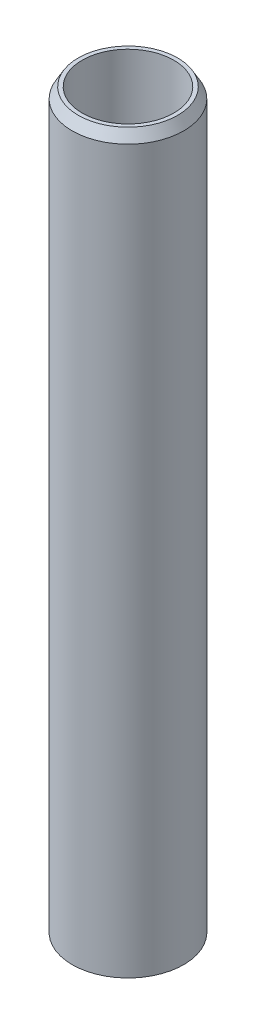
ISO-10303-21;
HEADER;
FILE_DESCRIPTION(('STEP AP214'),'2;1');
FILE_NAME('part.step','',(''),(''),'','','');
FILE_SCHEMA(('AUTOMOTIVE_DESIGN { 1 0 10303 214 1 1 1 1 }'));
ENDSEC;
DATA;
#1=APPLICATION_CONTEXT('core data for automotive mechanical design processes');
#2=APPLICATION_PROTOCOL_DEFINITION('international standard','automotive_design',2000,#1);
#3=PRODUCT_CONTEXT('',#1,'mechanical');
#4=PRODUCT('Part','Part','',(#3));
#5=PRODUCT_RELATED_PRODUCT_CATEGORY('part','',(#4));
#6=PRODUCT_DEFINITION_FORMATION('','',#4);
#7=PRODUCT_DEFINITION_CONTEXT('part definition',#1,'design');
#8=PRODUCT_DEFINITION('design','',#6,#7);
#9=PRODUCT_DEFINITION_SHAPE('','',#8);
#10=(LENGTH_UNIT() NAMED_UNIT(*) SI_UNIT(.MILLI.,.METRE.));
#11=(NAMED_UNIT(*) PLANE_ANGLE_UNIT() SI_UNIT($,.RADIAN.));
#12=(NAMED_UNIT(*) SI_UNIT($,.STERADIAN.) SOLID_ANGLE_UNIT());
#13=UNCERTAINTY_MEASURE_WITH_UNIT(LENGTH_MEASURE(1.E-05),#10,'distance_accuracy_value','');
#14=(GEOMETRIC_REPRESENTATION_CONTEXT(3) GLOBAL_UNCERTAINTY_ASSIGNED_CONTEXT((#13)) GLOBAL_UNIT_ASSIGNED_CONTEXT((#10,
#11,#12)) REPRESENTATION_CONTEXT('',''));
#15=CARTESIAN_POINT('',(0.,0.,0.));
#16=DIRECTION('',(0.,0.,1.));
#17=DIRECTION('',(1.,0.,0.));
#18=AXIS2_PLACEMENT_3D('',#15,#16,#17);
#19=CARTESIAN_POINT('',(0.,331.060461236108,0.));
#20=DIRECTION('',(0.,-1.,0.));
#21=DIRECTION('',(0.,0.,-1.));
#22=AXIS2_PLACEMENT_3D('',#19,#20,#21);
#23=CYLINDRICAL_SURFACE('',#22,25.);
#24=CARTESIAN_POINT('',(0.,326.370133227487,0.));
#25=DIRECTION('',(0.,1.,0.));
#26=DIRECTION('',(0.,0.,1.));
#27=AXIS2_PLACEMENT_3D('',#24,#25,#26);
#28=CIRCLE('',#27,25.);
#29=CARTESIAN_POINT('',(0.,326.370133227487,25.));
#30=VERTEX_POINT('',#29);
#31=EDGE_CURVE('E50',#30,#30,#28,.F.);
#32=ORIENTED_EDGE('',*,*,#31,.T.);
#33=EDGE_LOOP('',(#32));
#34=FACE_BOUND('',#33,.T.);
#35=CARTESIAN_POINT('',(0.,2.70796213836499,0.));
#36=DIRECTION('',(0.,1.,0.));
#37=DIRECTION('',(0.,0.,1.));
#38=AXIS2_PLACEMENT_3D('',#35,#36,#37);
#39=CIRCLE('',#38,25.);
#40=CARTESIAN_POINT('',(0.,2.70796213836499,25.));
#41=VERTEX_POINT('',#40);
#42=EDGE_CURVE('E51',#41,#41,#39,.T.);
#43=ORIENTED_EDGE('',*,*,#42,.T.);
#44=EDGE_LOOP('',(#43));
#45=FACE_BOUND('',#44,.T.);
#46=ADVANCED_FACE('F39',(#34,#45),#23,.T.);
#47=CARTESIAN_POINT('',(0.,331.060461236108,0.));
#48=DIRECTION('',(0.,1.,0.));
#49=DIRECTION('',(0.,0.,1.));
#50=AXIS2_PLACEMENT_3D('',#47,#48,#49);
#51=PLANE('',#50);
#52=CARTESIAN_POINT('',(0.,331.060461236108,0.));
#53=DIRECTION('',(0.,1.,0.));
#54=DIRECTION('',(0.,0.,1.));
#55=AXIS2_PLACEMENT_3D('',#52,#53,#54);
#56=CIRCLE('',#55,22.2920378616351);
#57=CARTESIAN_POINT('',(0.,331.060461236108,22.2920378616351));
#58=VERTEX_POINT('',#57);
#59=EDGE_CURVE('E54',#58,#58,#56,.T.);
#60=ORIENTED_EDGE('',*,*,#59,.T.);
#61=EDGE_LOOP('',(#60));
#62=FACE_BOUND('',#61,.T.);
#63=CARTESIAN_POINT('',(0.,331.060461236108,0.));
#64=DIRECTION('',(0.,1.,0.));
#65=DIRECTION('',(0.,0.,1.));
#66=AXIS2_PLACEMENT_3D('',#63,#64,#65);
#67=CIRCLE('',#66,20.5414140435443);
#68=CARTESIAN_POINT('',(0.,331.060461236108,20.5414140435443));
#69=VERTEX_POINT('',#68);
#70=EDGE_CURVE('E58',#69,#69,#67,.T.);
#71=ORIENTED_EDGE('',*,*,#70,.F.);
#72=EDGE_LOOP('',(#71));
#73=FACE_BOUND('',#72,.T.);
#74=ADVANCED_FACE('F68',(#62,#73),#51,.T.);
#75=CARTESIAN_POINT('',(0.,331.060461236108,0.));
#76=DIRECTION('',(0.,-1.,0.));
#77=DIRECTION('',(0.,0.,-1.));
#78=AXIS2_PLACEMENT_3D('',#75,#76,#77);
#79=CYLINDRICAL_SURFACE('',#78,20.5414140435443);
#80=CARTESIAN_POINT('',(0.,0.133796336200192,0.));
#81=DIRECTION('',(0.,1.,0.));
#82=DIRECTION('',(0.,0.,1.));
#83=AXIS2_PLACEMENT_3D('',#80,#81,#82);
#84=CIRCLE('',#83,20.5414140435443);
#85=CARTESIAN_POINT('',(0.,0.133796336200192,20.5414140435443));
#86=VERTEX_POINT('',#85);
#87=EDGE_CURVE('E10',#86,#86,#84,.F.);
#88=ORIENTED_EDGE('',*,*,#87,.T.);
#89=EDGE_LOOP('',(#88));
#90=FACE_BOUND('',#89,.T.);
#91=ORIENTED_EDGE('',*,*,#70,.T.);
#92=EDGE_LOOP('',(#91));
#93=FACE_BOUND('',#92,.T.);
#94=ADVANCED_FACE('F62',(#90,#93),#79,.F.);
#95=CARTESIAN_POINT('',(0.,331.060461236108,0.));
#96=DIRECTION('',(0.,-1.,0.));
#97=DIRECTION('',(0.,0.,-1.));
#98=AXIS2_PLACEMENT_3D('',#95,#96,#97);
#99=CONICAL_SURFACE('',#98,22.2920378616351,0.523598775598294);
#100=ORIENTED_EDGE('',*,*,#31,.F.);
#101=EDGE_LOOP('',(#100));
#102=FACE_BOUND('',#101,.T.);
#103=ORIENTED_EDGE('',*,*,#59,.F.);
#104=EDGE_LOOP('',(#103));
#105=FACE_BOUND('',#104,.T.);
#106=ADVANCED_FACE('F74',(#102,#105),#99,.T.);
#107=CARTESIAN_POINT('',(0.,2.70796213836499,0.));
#108=DIRECTION('',(0.,1.,0.));
#109=DIRECTION('',(0.,0.,1.));
#110=AXIS2_PLACEMENT_3D('',#107,#108,#109);
#111=CONICAL_SURFACE('',#110,25.,1.04719755119659);
#112=ORIENTED_EDGE('',*,*,#87,.F.);
#113=EDGE_LOOP('',(#112));
#114=FACE_BOUND('',#113,.T.);
#115=ORIENTED_EDGE('',*,*,#42,.F.);
#116=EDGE_LOOP('',(#115));
#117=FACE_BOUND('',#116,.T.);
#118=ADVANCED_FACE('F45',(#114,#117),#111,.T.);
#119=CLOSED_SHELL('',(#46,#74,#94,#106,#118));
#120=MANIFOLD_SOLID_BREP('B2',#119);
#121=ADVANCED_BREP_SHAPE_REPRESENTATION('',(#18,#120),#14);
#122=SHAPE_DEFINITION_REPRESENTATION(#9,#121);
ENDSEC;
END-ISO-10303-21;
